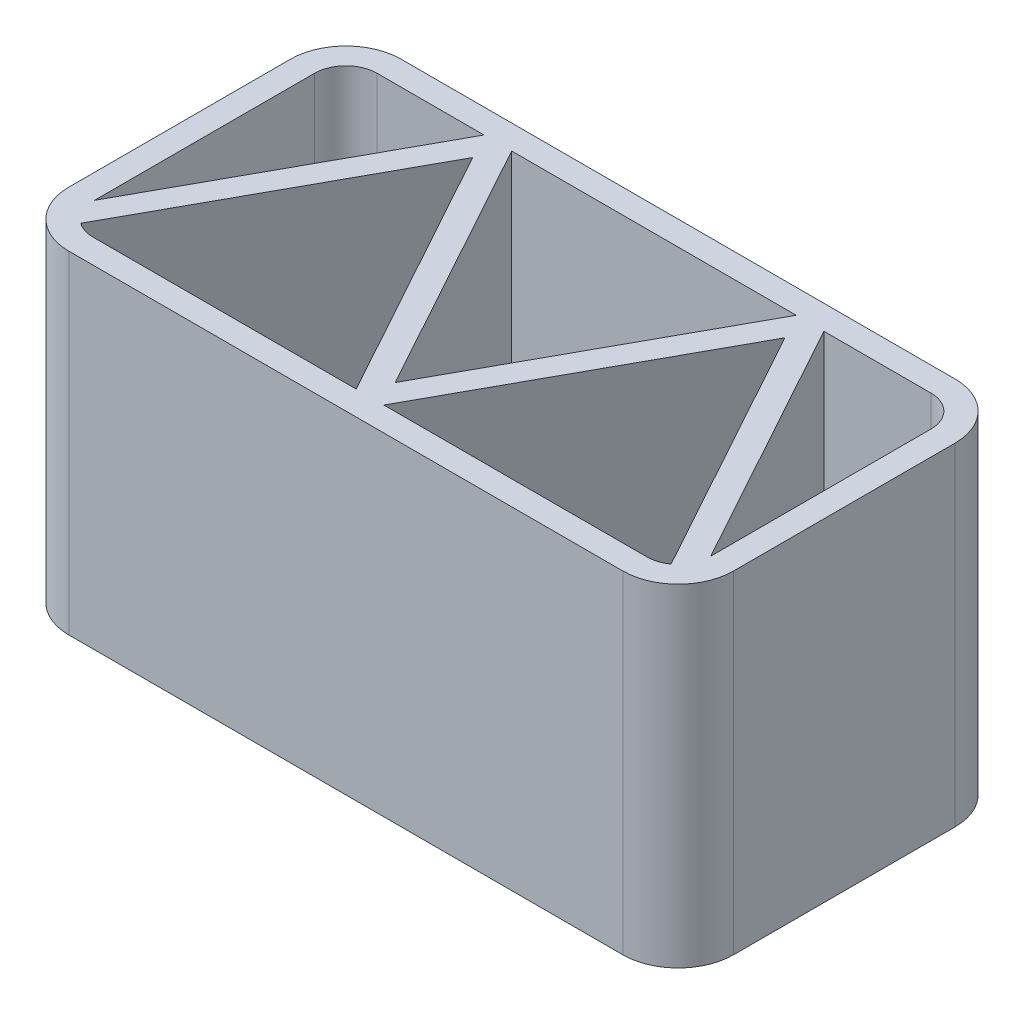
ISO-10303-21;
HEADER;
FILE_DESCRIPTION(('STEP AP214'),'2;1');
FILE_NAME('part.step','',(''),(''),'','','');
FILE_SCHEMA(('AUTOMOTIVE_DESIGN { 1 0 10303 214 1 1 1 1 }'));
ENDSEC;
DATA;
#1=APPLICATION_CONTEXT('core data for automotive mechanical design processes');
#2=APPLICATION_PROTOCOL_DEFINITION('international standard','automotive_design',2000,#1);
#3=PRODUCT_CONTEXT('',#1,'mechanical');
#4=PRODUCT('Part','Part','',(#3));
#5=PRODUCT_RELATED_PRODUCT_CATEGORY('part','',(#4));
#6=PRODUCT_DEFINITION_FORMATION('','',#4);
#7=PRODUCT_DEFINITION_CONTEXT('part definition',#1,'design');
#8=PRODUCT_DEFINITION('design','',#6,#7);
#9=PRODUCT_DEFINITION_SHAPE('','',#8);
#10=(LENGTH_UNIT() NAMED_UNIT(*) SI_UNIT(.MILLI.,.METRE.));
#11=(NAMED_UNIT(*) PLANE_ANGLE_UNIT() SI_UNIT($,.RADIAN.));
#12=(NAMED_UNIT(*) SI_UNIT($,.STERADIAN.) SOLID_ANGLE_UNIT());
#13=UNCERTAINTY_MEASURE_WITH_UNIT(LENGTH_MEASURE(1.E-05),#10,'distance_accuracy_value','');
#14=(GEOMETRIC_REPRESENTATION_CONTEXT(3) GLOBAL_UNCERTAINTY_ASSIGNED_CONTEXT((#13)) GLOBAL_UNIT_ASSIGNED_CONTEXT((#10,
#11,#12)) REPRESENTATION_CONTEXT('',''));
#15=CARTESIAN_POINT('',(0.,0.,0.));
#16=DIRECTION('',(0.,0.,1.));
#17=DIRECTION('',(1.,0.,0.));
#18=AXIS2_PLACEMENT_3D('',#15,#16,#17);
#19=CARTESIAN_POINT('',(254.,304.8,-130.175));
#20=DIRECTION('',(0.,0.,1.));
#21=DIRECTION('',(1.,0.,0.));
#22=AXIS2_PLACEMENT_3D('',#19,#20,#21);
#23=PLANE('',#22);
#24=DIRECTION('',(-1.,0.,0.));
#25=VECTOR('',#24,1.);
#26=CARTESIAN_POINT('',(254.,0.,-130.175));
#27=LINE('',#26,#25);
#28=CARTESIAN_POINT('',(-155.829753234846,0.,-130.175));
#29=VERTEX_POINT('',#28);
#30=CARTESIAN_POINT('',(-254.,0.,-130.175));
#31=VERTEX_POINT('',#30);
#32=EDGE_CURVE('E393',#29,#31,#27,.T.);
#33=ORIENTED_EDGE('',*,*,#32,.F.);
#34=DIRECTION('',(0.,1.,0.));
#35=VECTOR('',#34,1.);
#36=CARTESIAN_POINT('',(-155.829753234846,304.8,-130.175));
#37=LINE('',#36,#35);
#38=CARTESIAN_POINT('',(-155.829753234846,304.8,-130.175));
#39=VERTEX_POINT('',#38);
#40=EDGE_CURVE('E358',#29,#39,#37,.T.);
#41=ORIENTED_EDGE('',*,*,#40,.T.);
#42=DIRECTION('',(-1.,0.,0.));
#43=VECTOR('',#42,1.);
#44=CARTESIAN_POINT('',(254.,304.8,-130.175));
#45=LINE('',#44,#43);
#46=CARTESIAN_POINT('',(-254.,304.8,-130.175));
#47=VERTEX_POINT('',#46);
#48=EDGE_CURVE('E366',#39,#47,#45,.T.);
#49=ORIENTED_EDGE('',*,*,#48,.T.);
#50=DIRECTION('',(0.,-1.,0.));
#51=VECTOR('',#50,1.);
#52=CARTESIAN_POINT('',(-254.,304.8,-130.175));
#53=LINE('',#52,#51);
#54=EDGE_CURVE('E434',#47,#31,#53,.T.);
#55=ORIENTED_EDGE('',*,*,#54,.T.);
#56=EDGE_LOOP('',(#33,#41,#49,#55));
#57=FACE_BOUND('',#56,.T.);
#58=ADVANCED_FACE('F91',(#57),#23,.T.);
#59=CARTESIAN_POINT('',(130.466819062914,304.8,-130.175));
#60=VERTEX_POINT('',#59);
#61=CARTESIAN_POINT('',(-130.466819062914,304.8,-130.175));
#62=VERTEX_POINT('',#61);
#63=EDGE_CURVE('E106',#60,#62,#45,.T.);
#64=ORIENTED_EDGE('',*,*,#63,.T.);
#65=DIRECTION('',(0.,-1.,0.));
#66=VECTOR('',#65,1.);
#67=CARTESIAN_POINT('',(-130.466819062915,304.8,-130.175));
#68=LINE('',#67,#66);
#69=CARTESIAN_POINT('',(-130.466819062914,0.,-130.175));
#70=VERTEX_POINT('',#69);
#71=EDGE_CURVE('E12',#62,#70,#68,.T.);
#72=ORIENTED_EDGE('',*,*,#71,.T.);
#73=CARTESIAN_POINT('',(130.466819062914,0.,-130.175));
#74=VERTEX_POINT('',#73);
#75=EDGE_CURVE('E281',#74,#70,#27,.T.);
#76=ORIENTED_EDGE('',*,*,#75,.F.);
#77=DIRECTION('',(0.,1.,0.));
#78=VECTOR('',#77,1.);
#79=CARTESIAN_POINT('',(130.466819062914,304.8,-130.175));
#80=LINE('',#79,#78);
#81=EDGE_CURVE('E100',#74,#60,#80,.T.);
#82=ORIENTED_EDGE('',*,*,#81,.T.);
#83=EDGE_LOOP('',(#64,#72,#76,#82));
#84=FACE_BOUND('',#83,.T.);
#85=ADVANCED_FACE('F547',(#84),#23,.T.);
#86=CARTESIAN_POINT('',(254.,304.8,-130.175));
#87=VERTEX_POINT('',#86);
#88=CARTESIAN_POINT('',(155.829753234846,304.8,-130.175));
#89=VERTEX_POINT('',#88);
#90=EDGE_CURVE('E116',#87,#89,#45,.T.);
#91=ORIENTED_EDGE('',*,*,#90,.T.);
#92=DIRECTION('',(0.,-1.,0.));
#93=VECTOR('',#92,1.);
#94=CARTESIAN_POINT('',(155.829753234846,304.8,-130.175));
#95=LINE('',#94,#93);
#96=CARTESIAN_POINT('',(155.829753234846,0.,-130.175));
#97=VERTEX_POINT('',#96);
#98=EDGE_CURVE('E352',#89,#97,#95,.T.);
#99=ORIENTED_EDGE('',*,*,#98,.T.);
#100=CARTESIAN_POINT('',(254.,0.,-130.175));
#101=VERTEX_POINT('',#100);
#102=EDGE_CURVE('E394',#101,#97,#27,.T.);
#103=ORIENTED_EDGE('',*,*,#102,.F.);
#104=DIRECTION('',(0.,-1.,0.));
#105=VECTOR('',#104,1.);
#106=CARTESIAN_POINT('',(254.,304.8,-130.175));
#107=LINE('',#106,#105);
#108=EDGE_CURVE('E438',#87,#101,#107,.T.);
#109=ORIENTED_EDGE('',*,*,#108,.F.);
#110=EDGE_LOOP('',(#91,#99,#103,#109));
#111=FACE_BOUND('',#110,.T.);
#112=ADVANCED_FACE('F611',(#111),#23,.T.);
#113=CARTESIAN_POINT('',(-282.575,304.8,-101.6));
#114=DIRECTION('',(1.,0.,0.));
#115=DIRECTION('',(0.,0.,-1.));
#116=AXIS2_PLACEMENT_3D('',#113,#114,#115);
#117=PLANE('',#116);
#118=DIRECTION('',(0.,0.,1.));
#119=VECTOR('',#118,1.);
#120=CARTESIAN_POINT('',(-282.575,304.8,-101.6));
#121=LINE('',#120,#119);
#122=CARTESIAN_POINT('',(-282.575,304.8,-101.6));
#123=VERTEX_POINT('',#122);
#124=CARTESIAN_POINT('',(-282.575,304.8,100.342080455916));
#125=VERTEX_POINT('',#124);
#126=EDGE_CURVE('E373',#123,#125,#121,.T.);
#127=ORIENTED_EDGE('',*,*,#126,.T.);
#128=DIRECTION('',(0.,-1.,0.));
#129=VECTOR('',#128,1.);
#130=CARTESIAN_POINT('',(-282.575,304.8,100.342080455916));
#131=LINE('',#130,#129);
#132=CARTESIAN_POINT('',(-282.575,0.,100.342080455916));
#133=VERTEX_POINT('',#132);
#134=EDGE_CURVE('E544',#125,#133,#131,.T.);
#135=ORIENTED_EDGE('',*,*,#134,.T.);
#136=DIRECTION('',(0.,0.,1.));
#137=VECTOR('',#136,1.);
#138=CARTESIAN_POINT('',(-282.575,0.,-101.6));
#139=LINE('',#138,#137);
#140=CARTESIAN_POINT('',(-282.575,0.,-101.6));
#141=VERTEX_POINT('',#140);
#142=EDGE_CURVE('E402',#141,#133,#139,.T.);
#143=ORIENTED_EDGE('',*,*,#142,.F.);
#144=DIRECTION('',(0.,-1.,0.));
#145=VECTOR('',#144,1.);
#146=CARTESIAN_POINT('',(-282.575,304.8,-101.6));
#147=LINE('',#146,#145);
#148=EDGE_CURVE('E431',#123,#141,#147,.T.);
#149=ORIENTED_EDGE('',*,*,#148,.F.);
#150=EDGE_LOOP('',(#127,#135,#143,#149));
#151=FACE_BOUND('',#150,.T.);
#152=ADVANCED_FACE('F566',(#151),#117,.T.);
#153=CARTESIAN_POINT('',(254.,304.8,130.175));
#154=DIRECTION('',(0.,0.,-1.));
#155=DIRECTION('',(-1.,0.,0.));
#156=AXIS2_PLACEMENT_3D('',#153,#154,#155);
#157=PLANE('',#156);
#158=DIRECTION('',(0.,-1.,0.));
#159=VECTOR('',#158,1.);
#160=CARTESIAN_POINT('',(12.6814670859659,304.8,130.175));
#161=LINE('',#160,#159);
#162=CARTESIAN_POINT('',(12.6814670859659,304.8,130.175));
#163=VERTEX_POINT('',#162);
#164=CARTESIAN_POINT('',(12.6814670859659,0.,130.175));
#165=VERTEX_POINT('',#164);
#166=EDGE_CURVE('E536',#163,#165,#161,.T.);
#167=ORIENTED_EDGE('',*,*,#166,.F.);
#168=DIRECTION('',(1.,0.,0.));
#169=VECTOR('',#168,1.);
#170=CARTESIAN_POINT('',(254.,304.8,130.175));
#171=LINE('',#170,#169);
#172=CARTESIAN_POINT('',(254.,304.8,130.175));
#173=VERTEX_POINT('',#172);
#174=EDGE_CURVE('E379',#163,#173,#171,.T.);
#175=ORIENTED_EDGE('',*,*,#174,.T.);
#176=DIRECTION('',(0.,-1.,0.));
#177=VECTOR('',#176,1.);
#178=CARTESIAN_POINT('',(254.,304.8,130.175));
#179=LINE('',#178,#177);
#180=CARTESIAN_POINT('',(254.,0.,130.175));
#181=VERTEX_POINT('',#180);
#182=EDGE_CURVE('E423',#173,#181,#179,.T.);
#183=ORIENTED_EDGE('',*,*,#182,.T.);
#184=DIRECTION('',(1.,0.,0.));
#185=VECTOR('',#184,1.);
#186=CARTESIAN_POINT('',(254.,0.,130.175));
#187=LINE('',#186,#185);
#188=EDGE_CURVE('E409',#165,#181,#187,.T.);
#189=ORIENTED_EDGE('',*,*,#188,.F.);
#190=EDGE_LOOP('',(#167,#175,#183,#189));
#191=FACE_BOUND('',#190,.T.);
#192=ADVANCED_FACE('F584',(#191),#157,.T.);
#193=CARTESIAN_POINT('',(282.575,304.8,-101.6));
#194=DIRECTION('',(-1.,0.,0.));
#195=DIRECTION('',(0.,0.,1.));
#196=AXIS2_PLACEMENT_3D('',#193,#194,#195);
#197=PLANE('',#196);
#198=DIRECTION('',(0.,0.,-1.));
#199=VECTOR('',#198,1.);
#200=CARTESIAN_POINT('',(282.575,0.,-101.6));
#201=LINE('',#200,#199);
#202=CARTESIAN_POINT('',(282.575,0.,100.342080455916));
#203=VERTEX_POINT('',#202);
#204=CARTESIAN_POINT('',(282.575,0.,-101.6));
#205=VERTEX_POINT('',#204);
#206=EDGE_CURVE('E367',#203,#205,#201,.T.);
#207=ORIENTED_EDGE('',*,*,#206,.F.);
#208=DIRECTION('',(0.,1.,0.));
#209=VECTOR('',#208,1.);
#210=CARTESIAN_POINT('',(282.575,304.8,100.342080455916));
#211=LINE('',#210,#209);
#212=CARTESIAN_POINT('',(282.575,304.8,100.342080455916));
#213=VERTEX_POINT('',#212);
#214=EDGE_CURVE('E524',#203,#213,#211,.T.);
#215=ORIENTED_EDGE('',*,*,#214,.T.);
#216=DIRECTION('',(0.,0.,-1.));
#217=VECTOR('',#216,1.);
#218=CARTESIAN_POINT('',(282.575,304.8,-101.6));
#219=LINE('',#218,#217);
#220=CARTESIAN_POINT('',(282.575,304.8,-101.6));
#221=VERTEX_POINT('',#220);
#222=EDGE_CURVE('E386',#213,#221,#219,.T.);
#223=ORIENTED_EDGE('',*,*,#222,.T.);
#224=DIRECTION('',(0.,-1.,0.));
#225=VECTOR('',#224,1.);
#226=CARTESIAN_POINT('',(282.575,304.8,-101.6));
#227=LINE('',#226,#225);
#228=EDGE_CURVE('E389',#221,#205,#227,.T.);
#229=ORIENTED_EDGE('',*,*,#228,.T.);
#230=EDGE_LOOP('',(#207,#215,#223,#229));
#231=FACE_BOUND('',#230,.T.);
#232=ADVANCED_FACE('F625',(#231),#197,.T.);
#233=CARTESIAN_POINT('',(254.,304.8,-101.6));
#234=DIRECTION('',(0.,1.,0.));
#235=DIRECTION('',(0.,0.,1.));
#236=AXIS2_PLACEMENT_3D('',#233,#234,#235);
#237=PLANE('',#236);
#238=ORIENTED_EDGE('',*,*,#174,.F.);
#239=DIRECTION('',(0.481804493282131,0.,-0.876278740044028));
#240=VECTOR('',#239,1.);
#241=CARTESIAN_POINT('',(11.9633954984511,304.8,131.480987957236));
#242=LINE('',#241,#240);
#243=CARTESIAN_POINT('',(143.14828614888,304.8,-107.110665493072));
#244=VERTEX_POINT('',#243);
#245=EDGE_CURVE('E345',#163,#244,#242,.T.);
#246=ORIENTED_EDGE('',*,*,#245,.T.);
#247=DIRECTION('',(0.481804493282129,0.,0.876278740044029));
#248=VECTOR('',#247,1.);
#249=CARTESIAN_POINT('',(135.636386649853,304.8,-120.772883094041));
#250=LINE('',#249,#248);
#251=CARTESIAN_POINT('',(270.666076641867,304.8,124.81147376552));
#252=VERTEX_POINT('',#251);
#253=EDGE_CURVE('E321',#244,#252,#250,.T.);
#254=ORIENTED_EDGE('',*,*,#253,.T.);
#255=CARTESIAN_POINT('',(254.,304.8,101.6));
#256=DIRECTION('',(0.,-1.,0.));
#257=DIRECTION('',(-1.,0.,0.));
#258=AXIS2_PLACEMENT_3D('',#255,#256,#257);
#259=CIRCLE('',#258,28.575);
#260=EDGE_CURVE('E383',#173,#252,#259,.F.);
#261=ORIENTED_EDGE('',*,*,#260,.F.);
#262=EDGE_LOOP('',(#238,#246,#254,#261));
#263=FACE_BOUND('',#262,.T.);
#264=CARTESIAN_POINT('',(-254.,304.8,101.6));
#265=DIRECTION('',(0.,-1.,0.));
#266=DIRECTION('',(-1.,0.,0.));
#267=AXIS2_PLACEMENT_3D('',#264,#265,#266);
#268=CIRCLE('',#267,28.575);
#269=CARTESIAN_POINT('',(-270.666076641867,304.8,124.81147376552));
#270=VERTEX_POINT('',#269);
#271=CARTESIAN_POINT('',(-254.,304.8,130.175));
#272=VERTEX_POINT('',#271);
#273=EDGE_CURVE('E376',#270,#272,#268,.F.);
#274=ORIENTED_EDGE('',*,*,#273,.F.);
#275=DIRECTION('',(0.481804493282129,0.,-0.876278740044029));
#276=VECTOR('',#275,1.);
#277=CARTESIAN_POINT('',(-276.558924799021,304.8,135.529052431598));
#278=LINE('',#277,#276);
#279=CARTESIAN_POINT('',(-143.14828614888,304.8,-107.110665493072));
#280=VERTEX_POINT('',#279);
#281=EDGE_CURVE('E338',#270,#280,#278,.T.);
#282=ORIENTED_EDGE('',*,*,#281,.T.);
#283=DIRECTION('',(0.481804493282131,0.,0.876278740044028));
#284=VECTOR('',#283,1.);
#285=CARTESIAN_POINT('',(-150.660185647908,304.8,-120.772883094041));
#286=LINE('',#285,#284);
#287=CARTESIAN_POINT('',(-12.6814670859659,304.8,130.175));
#288=VERTEX_POINT('',#287);
#289=EDGE_CURVE('E341',#280,#288,#286,.T.);
#290=ORIENTED_EDGE('',*,*,#289,.T.);
#291=EDGE_CURVE('E380',#272,#288,#171,.T.);
#292=ORIENTED_EDGE('',*,*,#291,.F.);
#293=EDGE_LOOP('',(#274,#282,#290,#292));
#294=FACE_BOUND('',#293,.T.);
#295=DIRECTION('',(0.481804493282129,0.,-0.876278740044029));
#296=VECTOR('',#295,1.);
#297=CARTESIAN_POINT('',(-296.034219796499,304.8,124.820947568402));
#298=LINE('',#297,#296);
#299=EDGE_CURVE('E334',#125,#39,#298,.T.);
#300=ORIENTED_EDGE('',*,*,#299,.F.);
#301=ORIENTED_EDGE('',*,*,#126,.F.);
#302=CARTESIAN_POINT('',(-254.,304.8,-101.6));
#303=DIRECTION('',(0.,-1.,0.));
#304=DIRECTION('',(-1.,0.,0.));
#305=AXIS2_PLACEMENT_3D('',#302,#303,#304);
#306=CIRCLE('',#305,28.575);
#307=EDGE_CURVE('E370',#47,#123,#306,.F.);
#308=ORIENTED_EDGE('',*,*,#307,.F.);
#309=ORIENTED_EDGE('',*,*,#48,.F.);
#310=EDGE_LOOP('',(#300,#301,#308,#309));
#311=FACE_BOUND('',#310,.T.);
#312=DIRECTION('',(0.481804493282131,0.,0.876278740044028));
#313=VECTOR('',#312,1.);
#314=CARTESIAN_POINT('',(-131.184890650429,304.8,-131.480987957236));
#315=LINE('',#314,#313);
#316=CARTESIAN_POINT('',(0.,304.8,107.110665493072));
#317=VERTEX_POINT('',#316);
#318=EDGE_CURVE('E290',#62,#317,#315,.T.);
#319=ORIENTED_EDGE('',*,*,#318,.F.);
#320=ORIENTED_EDGE('',*,*,#63,.F.);
#321=DIRECTION('',(0.481804493282131,0.,-0.876278740044028));
#322=VECTOR('',#321,1.);
#323=CARTESIAN_POINT('',(-7.51189949902741,304.8,120.772883094041));
#324=LINE('',#323,#322);
#325=EDGE_CURVE('E329',#317,#60,#324,.T.);
#326=ORIENTED_EDGE('',*,*,#325,.F.);
#327=EDGE_LOOP('',(#319,#320,#326));
#328=FACE_BOUND('',#327,.T.);
#329=DIRECTION('',(0.481804493282129,0.,0.876278740044029));
#330=VECTOR('',#329,1.);
#331=CARTESIAN_POINT('',(155.111681647331,304.8,-131.480987957236));
#332=LINE('',#331,#330);
#333=EDGE_CURVE('E325',#89,#213,#332,.T.);
#334=ORIENTED_EDGE('',*,*,#333,.F.);
#335=ORIENTED_EDGE('',*,*,#90,.F.);
#336=CARTESIAN_POINT('',(254.,304.8,-101.6));
#337=DIRECTION('',(0.,-1.,0.));
#338=DIRECTION('',(-1.,0.,0.));
#339=AXIS2_PLACEMENT_3D('',#336,#337,#338);
#340=CIRCLE('',#339,28.5750000000001);
#341=EDGE_CURVE('E363',#221,#87,#340,.F.);
#342=ORIENTED_EDGE('',*,*,#341,.F.);
#343=ORIENTED_EDGE('',*,*,#222,.F.);
#344=EDGE_LOOP('',(#334,#335,#342,#343));
#345=FACE_BOUND('',#344,.T.);
#346=CARTESIAN_POINT('',(254.,304.8,-101.6));
#347=DIRECTION('',(0.,1.,0.));
#348=DIRECTION('',(0.,0.,-1.));
#349=AXIS2_PLACEMENT_3D('',#346,#347,#348);
#350=CIRCLE('',#349,50.8000000000001);
#351=CARTESIAN_POINT('',(304.8,304.8,-101.6));
#352=VERTEX_POINT('',#351);
#353=CARTESIAN_POINT('',(254.,304.8,-152.4));
#354=VERTEX_POINT('',#353);
#355=EDGE_CURVE('E443',#352,#354,#350,.T.);
#356=ORIENTED_EDGE('',*,*,#355,.T.);
#357=DIRECTION('',(-1.,0.,0.));
#358=VECTOR('',#357,1.);
#359=CARTESIAN_POINT('',(-254.,304.8,-152.4));
#360=LINE('',#359,#358);
#361=CARTESIAN_POINT('',(-254.,304.8,-152.4));
#362=VERTEX_POINT('',#361);
#363=EDGE_CURVE('E447',#354,#362,#360,.T.);
#364=ORIENTED_EDGE('',*,*,#363,.T.);
#365=CARTESIAN_POINT('',(-254.,304.8,-101.6));
#366=DIRECTION('',(0.,1.,0.));
#367=DIRECTION('',(0.,0.,1.));
#368=AXIS2_PLACEMENT_3D('',#365,#366,#367);
#369=CIRCLE('',#368,50.8);
#370=CARTESIAN_POINT('',(-304.8,304.8,-101.6));
#371=VERTEX_POINT('',#370);
#372=EDGE_CURVE('E451',#362,#371,#369,.T.);
#373=ORIENTED_EDGE('',*,*,#372,.T.);
#374=DIRECTION('',(0.,0.,1.));
#375=VECTOR('',#374,1.);
#376=CARTESIAN_POINT('',(-304.8,304.8,-101.6));
#377=LINE('',#376,#375);
#378=CARTESIAN_POINT('',(-304.8,304.8,101.6));
#379=VERTEX_POINT('',#378);
#380=EDGE_CURVE('E454',#371,#379,#377,.T.);
#381=ORIENTED_EDGE('',*,*,#380,.T.);
#382=CARTESIAN_POINT('',(-254.,304.8,101.6));
#383=DIRECTION('',(0.,1.,0.));
#384=DIRECTION('',(0.,0.,1.));
#385=AXIS2_PLACEMENT_3D('',#382,#383,#384);
#386=CIRCLE('',#385,50.8);
#387=CARTESIAN_POINT('',(-254.,304.8,152.4));
#388=VERTEX_POINT('',#387);
#389=EDGE_CURVE('E457',#379,#388,#386,.T.);
#390=ORIENTED_EDGE('',*,*,#389,.T.);
#391=DIRECTION('',(1.,0.,0.));
#392=VECTOR('',#391,1.);
#393=CARTESIAN_POINT('',(-254.,304.8,152.4));
#394=LINE('',#393,#392);
#395=CARTESIAN_POINT('',(254.,304.8,152.4));
#396=VERTEX_POINT('',#395);
#397=EDGE_CURVE('E460',#388,#396,#394,.T.);
#398=ORIENTED_EDGE('',*,*,#397,.T.);
#399=CARTESIAN_POINT('',(254.,304.8,101.6));
#400=DIRECTION('',(0.,1.,0.));
#401=DIRECTION('',(0.,0.,1.));
#402=AXIS2_PLACEMENT_3D('',#399,#400,#401);
#403=CIRCLE('',#402,50.8);
#404=CARTESIAN_POINT('',(304.8,304.8,101.6));
#405=VERTEX_POINT('',#404);
#406=EDGE_CURVE('E463',#396,#405,#403,.T.);
#407=ORIENTED_EDGE('',*,*,#406,.T.);
#408=DIRECTION('',(0.,0.,-1.));
#409=VECTOR('',#408,1.);
#410=CARTESIAN_POINT('',(304.8,304.8,-101.6));
#411=LINE('',#410,#409);
#412=EDGE_CURVE('E466',#405,#352,#411,.T.);
#413=ORIENTED_EDGE('',*,*,#412,.T.);
#414=EDGE_LOOP('',(#356,#364,#373,#381,#390,#398,#407,#413));
#415=FACE_BOUND('',#414,.T.);
#416=ADVANCED_FACE('F549',(#263,#294,#311,#328,#345,#415),#237,.T.);
#417=CARTESIAN_POINT('',(254.,0.,-101.6));
#418=DIRECTION('',(0.,1.,0.));
#419=DIRECTION('',(0.,0.,1.));
#420=AXIS2_PLACEMENT_3D('',#417,#418,#419);
#421=PLANE('',#420);
#422=DIRECTION('',(0.481804493282131,0.,-0.876278740044028));
#423=VECTOR('',#422,1.);
#424=CARTESIAN_POINT('',(11.9633954984511,0.,131.480987957236));
#425=LINE('',#424,#423);
#426=CARTESIAN_POINT('',(143.14828614888,0.,-107.110665493072));
#427=VERTEX_POINT('',#426);
#428=EDGE_CURVE('E296',#165,#427,#425,.T.);
#429=ORIENTED_EDGE('',*,*,#428,.F.);
#430=ORIENTED_EDGE('',*,*,#188,.T.);
#431=CARTESIAN_POINT('',(254.,0.,101.6));
#432=DIRECTION('',(0.,-1.,0.));
#433=DIRECTION('',(-1.,0.,0.));
#434=AXIS2_PLACEMENT_3D('',#431,#432,#433);
#435=CIRCLE('',#434,28.575);
#436=CARTESIAN_POINT('',(270.666076641867,0.,124.81147376552));
#437=VERTEX_POINT('',#436);
#438=EDGE_CURVE('E414',#181,#437,#435,.F.);
#439=ORIENTED_EDGE('',*,*,#438,.T.);
#440=DIRECTION('',(0.481804493282129,0.,0.876278740044029));
#441=VECTOR('',#440,1.);
#442=CARTESIAN_POINT('',(135.636386649853,0.,-120.772883094041));
#443=LINE('',#442,#441);
#444=EDGE_CURVE('E305',#427,#437,#443,.T.);
#445=ORIENTED_EDGE('',*,*,#444,.F.);
#446=EDGE_LOOP('',(#429,#430,#439,#445));
#447=FACE_BOUND('',#446,.T.);
#448=DIRECTION('',(0.481804493282129,0.,-0.876278740044029));
#449=VECTOR('',#448,1.);
#450=CARTESIAN_POINT('',(-276.558924799021,0.,135.529052431598));
#451=LINE('',#450,#449);
#452=CARTESIAN_POINT('',(-270.666076641867,0.,124.81147376552));
#453=VERTEX_POINT('',#452);
#454=CARTESIAN_POINT('',(-143.14828614888,0.,-107.110665493072));
#455=VERTEX_POINT('',#454);
#456=EDGE_CURVE('E312',#453,#455,#451,.T.);
#457=ORIENTED_EDGE('',*,*,#456,.F.);
#458=CARTESIAN_POINT('',(-254.,0.,101.6));
#459=DIRECTION('',(0.,-1.,0.));
#460=DIRECTION('',(-1.,0.,0.));
#461=AXIS2_PLACEMENT_3D('',#458,#459,#460);
#462=CIRCLE('',#461,28.575);
#463=CARTESIAN_POINT('',(-254.,0.,130.175));
#464=VERTEX_POINT('',#463);
#465=EDGE_CURVE('E406',#453,#464,#462,.F.);
#466=ORIENTED_EDGE('',*,*,#465,.T.);
#467=CARTESIAN_POINT('',(-12.6814670859659,0.,130.175));
#468=VERTEX_POINT('',#467);
#469=EDGE_CURVE('E410',#464,#468,#187,.T.);
#470=ORIENTED_EDGE('',*,*,#469,.T.);
#471=DIRECTION('',(0.481804493282131,0.,0.876278740044028));
#472=VECTOR('',#471,1.);
#473=CARTESIAN_POINT('',(-150.660185647908,0.,-120.772883094041));
#474=LINE('',#473,#472);
#475=EDGE_CURVE('E315',#455,#468,#474,.T.);
#476=ORIENTED_EDGE('',*,*,#475,.F.);
#477=EDGE_LOOP('',(#457,#466,#470,#476));
#478=FACE_BOUND('',#477,.T.);
#479=ORIENTED_EDGE('',*,*,#142,.T.);
#480=DIRECTION('',(0.481804493282129,0.,-0.876278740044029));
#481=VECTOR('',#480,1.);
#482=CARTESIAN_POINT('',(-296.034219796499,0.,124.820947568402));
#483=LINE('',#482,#481);
#484=EDGE_CURVE('E284',#133,#29,#483,.T.);
#485=ORIENTED_EDGE('',*,*,#484,.T.);
#486=ORIENTED_EDGE('',*,*,#32,.T.);
#487=CARTESIAN_POINT('',(-254.,0.,-101.6));
#488=DIRECTION('',(0.,-1.,0.));
#489=DIRECTION('',(-1.,0.,0.));
#490=AXIS2_PLACEMENT_3D('',#487,#488,#489);
#491=CIRCLE('',#490,28.575);
#492=EDGE_CURVE('E398',#31,#141,#491,.F.);
#493=ORIENTED_EDGE('',*,*,#492,.T.);
#494=EDGE_LOOP('',(#479,#485,#486,#493));
#495=FACE_BOUND('',#494,.T.);
#496=ORIENTED_EDGE('',*,*,#75,.T.);
#497=DIRECTION('',(0.481804493282131,0.,0.876278740044028));
#498=VECTOR('',#497,1.);
#499=CARTESIAN_POINT('',(-131.184890650429,0.,-131.480987957236));
#500=LINE('',#499,#498);
#501=CARTESIAN_POINT('',(0.,0.,107.110665493072));
#502=VERTEX_POINT('',#501);
#503=EDGE_CURVE('E275',#70,#502,#500,.T.);
#504=ORIENTED_EDGE('',*,*,#503,.T.);
#505=DIRECTION('',(0.481804493282131,0.,-0.876278740044028));
#506=VECTOR('',#505,1.);
#507=CARTESIAN_POINT('',(-7.51189949902741,0.,120.772883094041));
#508=LINE('',#507,#506);
#509=EDGE_CURVE('E280',#502,#74,#508,.T.);
#510=ORIENTED_EDGE('',*,*,#509,.T.);
#511=EDGE_LOOP('',(#496,#504,#510));
#512=FACE_BOUND('',#511,.T.);
#513=ORIENTED_EDGE('',*,*,#102,.T.);
#514=DIRECTION('',(0.481804493282129,0.,0.876278740044029));
#515=VECTOR('',#514,1.);
#516=CARTESIAN_POINT('',(155.111681647331,0.,-131.480987957236));
#517=LINE('',#516,#515);
#518=EDGE_CURVE('E301',#97,#203,#517,.T.);
#519=ORIENTED_EDGE('',*,*,#518,.T.);
#520=ORIENTED_EDGE('',*,*,#206,.T.);
#521=CARTESIAN_POINT('',(254.,0.,-101.6));
#522=DIRECTION('',(0.,-1.,0.));
#523=DIRECTION('',(-1.,0.,0.));
#524=AXIS2_PLACEMENT_3D('',#521,#522,#523);
#525=CIRCLE('',#524,28.5750000000001);
#526=EDGE_CURVE('E362',#205,#101,#525,.F.);
#527=ORIENTED_EDGE('',*,*,#526,.T.);
#528=EDGE_LOOP('',(#513,#519,#520,#527));
#529=FACE_BOUND('',#528,.T.);
#530=CARTESIAN_POINT('',(254.,0.,-101.6));
#531=DIRECTION('',(0.,1.,0.));
#532=DIRECTION('',(0.,0.,-1.));
#533=AXIS2_PLACEMENT_3D('',#530,#531,#532);
#534=CIRCLE('',#533,50.8000000000001);
#535=CARTESIAN_POINT('',(304.8,0.,-101.6));
#536=VERTEX_POINT('',#535);
#537=CARTESIAN_POINT('',(254.,0.,-152.4));
#538=VERTEX_POINT('',#537);
#539=EDGE_CURVE('E442',#536,#538,#534,.T.);
#540=ORIENTED_EDGE('',*,*,#539,.F.);
#541=DIRECTION('',(0.,0.,-1.));
#542=VECTOR('',#541,1.);
#543=CARTESIAN_POINT('',(304.8,0.,-101.6));
#544=LINE('',#543,#542);
#545=CARTESIAN_POINT('',(304.8,0.,101.6));
#546=VERTEX_POINT('',#545);
#547=EDGE_CURVE('E448',#546,#536,#544,.T.);
#548=ORIENTED_EDGE('',*,*,#547,.F.);
#549=CARTESIAN_POINT('',(254.,0.,101.6));
#550=DIRECTION('',(0.,1.,0.));
#551=DIRECTION('',(0.,0.,1.));
#552=AXIS2_PLACEMENT_3D('',#549,#550,#551);
#553=CIRCLE('',#552,50.8);
#554=CARTESIAN_POINT('',(254.,0.,152.4));
#555=VERTEX_POINT('',#554);
#556=EDGE_CURVE('E488',#555,#546,#553,.T.);
#557=ORIENTED_EDGE('',*,*,#556,.F.);
#558=DIRECTION('',(1.,0.,0.));
#559=VECTOR('',#558,1.);
#560=CARTESIAN_POINT('',(-254.,0.,152.4));
#561=LINE('',#560,#559);
#562=CARTESIAN_POINT('',(-254.,0.,152.4));
#563=VERTEX_POINT('',#562);
#564=EDGE_CURVE('E485',#563,#555,#561,.T.);
#565=ORIENTED_EDGE('',*,*,#564,.F.);
#566=CARTESIAN_POINT('',(-254.,0.,101.6));
#567=DIRECTION('',(0.,1.,0.));
#568=DIRECTION('',(0.,0.,1.));
#569=AXIS2_PLACEMENT_3D('',#566,#567,#568);
#570=CIRCLE('',#569,50.8);
#571=CARTESIAN_POINT('',(-304.8,0.,101.6));
#572=VERTEX_POINT('',#571);
#573=EDGE_CURVE('E482',#572,#563,#570,.T.);
#574=ORIENTED_EDGE('',*,*,#573,.F.);
#575=DIRECTION('',(0.,0.,1.));
#576=VECTOR('',#575,1.);
#577=CARTESIAN_POINT('',(-304.8,0.,-101.6));
#578=LINE('',#577,#576);
#579=CARTESIAN_POINT('',(-304.8,0.,-101.6));
#580=VERTEX_POINT('',#579);
#581=EDGE_CURVE('E479',#580,#572,#578,.T.);
#582=ORIENTED_EDGE('',*,*,#581,.F.);
#583=CARTESIAN_POINT('',(-254.,0.,-101.6));
#584=DIRECTION('',(0.,1.,0.));
#585=DIRECTION('',(0.,0.,1.));
#586=AXIS2_PLACEMENT_3D('',#583,#584,#585);
#587=CIRCLE('',#586,50.8);
#588=CARTESIAN_POINT('',(-254.,0.,-152.4));
#589=VERTEX_POINT('',#588);
#590=EDGE_CURVE('E476',#589,#580,#587,.T.);
#591=ORIENTED_EDGE('',*,*,#590,.F.);
#592=DIRECTION('',(-1.,0.,0.));
#593=VECTOR('',#592,1.);
#594=CARTESIAN_POINT('',(-254.,0.,-152.4));
#595=LINE('',#594,#593);
#596=EDGE_CURVE('E473',#538,#589,#595,.T.);
#597=ORIENTED_EDGE('',*,*,#596,.F.);
#598=EDGE_LOOP('',(#540,#548,#557,#565,#574,#582,#591,#597));
#599=FACE_BOUND('',#598,.T.);
#600=ADVANCED_FACE('F277',(#447,#478,#495,#512,#529,#599),#421,.F.);
#601=CARTESIAN_POINT('',(254.,304.8,-101.6));
#602=DIRECTION('',(0.,-1.,0.));
#603=DIRECTION('',(0.,0.,-1.));
#604=AXIS2_PLACEMENT_3D('',#601,#602,#603);
#605=CYLINDRICAL_SURFACE('',#604,50.8000000000001);
#606=ORIENTED_EDGE('',*,*,#539,.T.);
#607=DIRECTION('',(0.,-1.,0.));
#608=VECTOR('',#607,1.);
#609=CARTESIAN_POINT('',(254.,304.8,-152.4));
#610=LINE('',#609,#608);
#611=EDGE_CURVE('E520',#354,#538,#610,.T.);
#612=ORIENTED_EDGE('',*,*,#611,.F.);
#613=ORIENTED_EDGE('',*,*,#355,.F.);
#614=DIRECTION('',(0.,-1.,0.));
#615=VECTOR('',#614,1.);
#616=CARTESIAN_POINT('',(304.8,304.8,-101.6));
#617=LINE('',#616,#615);
#618=EDGE_CURVE('E469',#352,#536,#617,.T.);
#619=ORIENTED_EDGE('',*,*,#618,.T.);
#620=EDGE_LOOP('',(#606,#612,#613,#619));
#621=FACE_BOUND('',#620,.T.);
#622=ADVANCED_FACE('F93',(#621),#605,.T.);
#623=CARTESIAN_POINT('',(-254.,304.8,-152.4));
#624=DIRECTION('',(0.,0.,1.));
#625=DIRECTION('',(1.,0.,0.));
#626=AXIS2_PLACEMENT_3D('',#623,#624,#625);
#627=PLANE('',#626);
#628=ORIENTED_EDGE('',*,*,#596,.T.);
#629=DIRECTION('',(0.,-1.,0.));
#630=VECTOR('',#629,1.);
#631=CARTESIAN_POINT('',(-254.,304.8,-152.4));
#632=LINE('',#631,#630);
#633=EDGE_CURVE('E516',#362,#589,#632,.T.);
#634=ORIENTED_EDGE('',*,*,#633,.F.);
#635=ORIENTED_EDGE('',*,*,#363,.F.);
#636=ORIENTED_EDGE('',*,*,#611,.T.);
#637=EDGE_LOOP('',(#628,#634,#635,#636));
#638=FACE_BOUND('',#637,.T.);
#639=ADVANCED_FACE('F668',(#638),#627,.F.);
#640=CARTESIAN_POINT('',(-254.,304.8,-101.6));
#641=DIRECTION('',(0.,-1.,0.));
#642=DIRECTION('',(0.,0.,-1.));
#643=AXIS2_PLACEMENT_3D('',#640,#641,#642);
#644=CYLINDRICAL_SURFACE('',#643,50.8);
#645=ORIENTED_EDGE('',*,*,#590,.T.);
#646=DIRECTION('',(0.,-1.,0.));
#647=VECTOR('',#646,1.);
#648=CARTESIAN_POINT('',(-304.8,304.8,-101.6));
#649=LINE('',#648,#647);
#650=EDGE_CURVE('E512',#371,#580,#649,.T.);
#651=ORIENTED_EDGE('',*,*,#650,.F.);
#652=ORIENTED_EDGE('',*,*,#372,.F.);
#653=ORIENTED_EDGE('',*,*,#633,.T.);
#654=EDGE_LOOP('',(#645,#651,#652,#653));
#655=FACE_BOUND('',#654,.T.);
#656=ADVANCED_FACE('F665',(#655),#644,.T.);
#657=CARTESIAN_POINT('',(-304.8,304.8,-101.6));
#658=DIRECTION('',(1.,0.,0.));
#659=DIRECTION('',(0.,0.,-1.));
#660=AXIS2_PLACEMENT_3D('',#657,#658,#659);
#661=PLANE('',#660);
#662=ORIENTED_EDGE('',*,*,#581,.T.);
#663=DIRECTION('',(0.,-1.,0.));
#664=VECTOR('',#663,1.);
#665=CARTESIAN_POINT('',(-304.8,304.8,101.6));
#666=LINE('',#665,#664);
#667=EDGE_CURVE('E508',#379,#572,#666,.T.);
#668=ORIENTED_EDGE('',*,*,#667,.F.);
#669=ORIENTED_EDGE('',*,*,#380,.F.);
#670=ORIENTED_EDGE('',*,*,#650,.T.);
#671=EDGE_LOOP('',(#662,#668,#669,#670));
#672=FACE_BOUND('',#671,.T.);
#673=ADVANCED_FACE('F661',(#672),#661,.F.);
#674=CARTESIAN_POINT('',(-254.,304.8,101.6));
#675=DIRECTION('',(0.,-1.,0.));
#676=DIRECTION('',(0.,0.,-1.));
#677=AXIS2_PLACEMENT_3D('',#674,#675,#676);
#678=CYLINDRICAL_SURFACE('',#677,50.8);
#679=ORIENTED_EDGE('',*,*,#573,.T.);
#680=DIRECTION('',(0.,-1.,0.));
#681=VECTOR('',#680,1.);
#682=CARTESIAN_POINT('',(-254.,304.8,152.4));
#683=LINE('',#682,#681);
#684=EDGE_CURVE('E504',#388,#563,#683,.T.);
#685=ORIENTED_EDGE('',*,*,#684,.F.);
#686=ORIENTED_EDGE('',*,*,#389,.F.);
#687=ORIENTED_EDGE('',*,*,#667,.T.);
#688=EDGE_LOOP('',(#679,#685,#686,#687));
#689=FACE_BOUND('',#688,.T.);
#690=ADVANCED_FACE('F657',(#689),#678,.T.);
#691=CARTESIAN_POINT('',(-254.,304.8,152.4));
#692=DIRECTION('',(0.,0.,-1.));
#693=DIRECTION('',(-1.,0.,0.));
#694=AXIS2_PLACEMENT_3D('',#691,#692,#693);
#695=PLANE('',#694);
#696=ORIENTED_EDGE('',*,*,#564,.T.);
#697=DIRECTION('',(0.,-1.,0.));
#698=VECTOR('',#697,1.);
#699=CARTESIAN_POINT('',(254.,304.8,152.4));
#700=LINE('',#699,#698);
#701=EDGE_CURVE('E500',#396,#555,#700,.T.);
#702=ORIENTED_EDGE('',*,*,#701,.F.);
#703=ORIENTED_EDGE('',*,*,#397,.F.);
#704=ORIENTED_EDGE('',*,*,#684,.T.);
#705=EDGE_LOOP('',(#696,#702,#703,#704));
#706=FACE_BOUND('',#705,.T.);
#707=ADVANCED_FACE('F653',(#706),#695,.F.);
#708=CARTESIAN_POINT('',(254.,304.8,101.6));
#709=DIRECTION('',(0.,-1.,0.));
#710=DIRECTION('',(0.,0.,-1.));
#711=AXIS2_PLACEMENT_3D('',#708,#709,#710);
#712=CYLINDRICAL_SURFACE('',#711,50.8);
#713=ORIENTED_EDGE('',*,*,#556,.T.);
#714=DIRECTION('',(0.,-1.,0.));
#715=VECTOR('',#714,1.);
#716=CARTESIAN_POINT('',(304.8,304.8,101.6));
#717=LINE('',#716,#715);
#718=EDGE_CURVE('E496',#405,#546,#717,.T.);
#719=ORIENTED_EDGE('',*,*,#718,.F.);
#720=ORIENTED_EDGE('',*,*,#406,.F.);
#721=ORIENTED_EDGE('',*,*,#701,.T.);
#722=EDGE_LOOP('',(#713,#719,#720,#721));
#723=FACE_BOUND('',#722,.T.);
#724=ADVANCED_FACE('F642',(#723),#712,.T.);
#725=CARTESIAN_POINT('',(304.8,304.8,-101.6));
#726=DIRECTION('',(-1.,0.,0.));
#727=DIRECTION('',(0.,0.,1.));
#728=AXIS2_PLACEMENT_3D('',#725,#726,#727);
#729=PLANE('',#728);
#730=ORIENTED_EDGE('',*,*,#547,.T.);
#731=ORIENTED_EDGE('',*,*,#618,.F.);
#732=ORIENTED_EDGE('',*,*,#412,.F.);
#733=ORIENTED_EDGE('',*,*,#718,.T.);
#734=EDGE_LOOP('',(#730,#731,#732,#733));
#735=FACE_BOUND('',#734,.T.);
#736=ADVANCED_FACE('F637',(#735),#729,.F.);
#737=CARTESIAN_POINT('',(254.,304.8,-101.6));
#738=DIRECTION('',(0.,-1.,0.));
#739=DIRECTION('',(0.,0.,-1.));
#740=AXIS2_PLACEMENT_3D('',#737,#738,#739);
#741=CYLINDRICAL_SURFACE('',#740,28.5750000000001);
#742=ORIENTED_EDGE('',*,*,#526,.F.);
#743=ORIENTED_EDGE('',*,*,#228,.F.);
#744=ORIENTED_EDGE('',*,*,#341,.T.);
#745=ORIENTED_EDGE('',*,*,#108,.T.);
#746=EDGE_LOOP('',(#742,#743,#744,#745));
#747=FACE_BOUND('',#746,.T.);
#748=ADVANCED_FACE('F631',(#747),#741,.F.);
#749=CARTESIAN_POINT('',(-254.,304.8,-101.6));
#750=DIRECTION('',(0.,-1.,0.));
#751=DIRECTION('',(0.,0.,-1.));
#752=AXIS2_PLACEMENT_3D('',#749,#750,#751);
#753=CYLINDRICAL_SURFACE('',#752,28.575);
#754=ORIENTED_EDGE('',*,*,#492,.F.);
#755=ORIENTED_EDGE('',*,*,#54,.F.);
#756=ORIENTED_EDGE('',*,*,#307,.T.);
#757=ORIENTED_EDGE('',*,*,#148,.T.);
#758=EDGE_LOOP('',(#754,#755,#756,#757));
#759=FACE_BOUND('',#758,.T.);
#760=ADVANCED_FACE('F561',(#759),#753,.F.);
#761=CARTESIAN_POINT('',(-254.,304.8,101.6));
#762=DIRECTION('',(0.,-1.,0.));
#763=DIRECTION('',(0.,0.,-1.));
#764=AXIS2_PLACEMENT_3D('',#761,#762,#763);
#765=CYLINDRICAL_SURFACE('',#764,28.575);
#766=DIRECTION('',(0.,-1.,0.));
#767=VECTOR('',#766,1.);
#768=CARTESIAN_POINT('',(-270.666076641867,304.8,124.81147376552));
#769=LINE('',#768,#767);
#770=EDGE_CURVE('E540',#270,#453,#769,.T.);
#771=ORIENTED_EDGE('',*,*,#770,.F.);
#772=ORIENTED_EDGE('',*,*,#273,.T.);
#773=DIRECTION('',(0.,-1.,0.));
#774=VECTOR('',#773,1.);
#775=CARTESIAN_POINT('',(-254.,304.8,130.175));
#776=LINE('',#775,#774);
#777=EDGE_CURVE('E427',#272,#464,#776,.T.);
#778=ORIENTED_EDGE('',*,*,#777,.T.);
#779=ORIENTED_EDGE('',*,*,#465,.F.);
#780=EDGE_LOOP('',(#771,#772,#778,#779));
#781=FACE_BOUND('',#780,.T.);
#782=ADVANCED_FACE('F629',(#781),#765,.F.);
#783=DIRECTION('',(0.,1.,0.));
#784=VECTOR('',#783,1.);
#785=CARTESIAN_POINT('',(-12.6814670859659,304.8,130.175));
#786=LINE('',#785,#784);
#787=EDGE_CURVE('E532',#468,#288,#786,.T.);
#788=ORIENTED_EDGE('',*,*,#787,.F.);
#789=ORIENTED_EDGE('',*,*,#469,.F.);
#790=ORIENTED_EDGE('',*,*,#777,.F.);
#791=ORIENTED_EDGE('',*,*,#291,.T.);
#792=EDGE_LOOP('',(#788,#789,#790,#791));
#793=FACE_BOUND('',#792,.T.);
#794=ADVANCED_FACE('F627',(#793),#157,.T.);
#795=CARTESIAN_POINT('',(254.,304.8,101.6));
#796=DIRECTION('',(0.,-1.,0.));
#797=DIRECTION('',(0.,0.,-1.));
#798=AXIS2_PLACEMENT_3D('',#795,#796,#797);
#799=CYLINDRICAL_SURFACE('',#798,28.575);
#800=DIRECTION('',(0.,-1.,0.));
#801=VECTOR('',#800,1.);
#802=CARTESIAN_POINT('',(270.666076641867,304.8,124.81147376552));
#803=LINE('',#802,#801);
#804=EDGE_CURVE('E528',#437,#252,#803,.F.);
#805=ORIENTED_EDGE('',*,*,#804,.F.);
#806=ORIENTED_EDGE('',*,*,#438,.F.);
#807=ORIENTED_EDGE('',*,*,#182,.F.);
#808=ORIENTED_EDGE('',*,*,#260,.T.);
#809=EDGE_LOOP('',(#805,#806,#807,#808));
#810=FACE_BOUND('',#809,.T.);
#811=ADVANCED_FACE('F587',(#810),#799,.F.);
#812=CARTESIAN_POINT('',(135.636386649853,0.,-120.772883094041));
#813=DIRECTION('',(-0.876278740044029,0.,0.481804493282129));
#814=DIRECTION('',(0.481804493282129,0.,0.876278740044029));
#815=AXIS2_PLACEMENT_3D('',#812,#813,#814);
#816=PLANE('',#815);
#817=ORIENTED_EDGE('',*,*,#444,.T.);
#818=ORIENTED_EDGE('',*,*,#804,.T.);
#819=ORIENTED_EDGE('',*,*,#253,.F.);
#820=DIRECTION('',(0.,1.,0.));
#821=VECTOR('',#820,1.);
#822=CARTESIAN_POINT('',(143.14828614888,0.,-107.110665493072));
#823=LINE('',#822,#821);
#824=EDGE_CURVE('E348',#427,#244,#823,.T.);
#825=ORIENTED_EDGE('',*,*,#824,.F.);
#826=EDGE_LOOP('',(#817,#818,#819,#825));
#827=FACE_BOUND('',#826,.T.);
#828=ADVANCED_FACE('F590',(#827),#816,.T.);
#829=CARTESIAN_POINT('',(11.9633954984511,0.,131.480987957236));
#830=DIRECTION('',(0.876278740044028,0.,0.481804493282131));
#831=DIRECTION('',(0.481804493282131,0.,-0.876278740044028));
#832=AXIS2_PLACEMENT_3D('',#829,#830,#831);
#833=PLANE('',#832);
#834=ORIENTED_EDGE('',*,*,#245,.F.);
#835=ORIENTED_EDGE('',*,*,#166,.T.);
#836=ORIENTED_EDGE('',*,*,#428,.T.);
#837=ORIENTED_EDGE('',*,*,#824,.T.);
#838=EDGE_LOOP('',(#834,#835,#836,#837));
#839=FACE_BOUND('',#838,.T.);
#840=ADVANCED_FACE('F596',(#839),#833,.T.);
#841=CARTESIAN_POINT('',(-150.660185647908,0.,-120.772883094041));
#842=DIRECTION('',(-0.876278740044028,0.,0.481804493282131));
#843=DIRECTION('',(0.481804493282131,0.,0.876278740044028));
#844=AXIS2_PLACEMENT_3D('',#841,#842,#843);
#845=PLANE('',#844);
#846=ORIENTED_EDGE('',*,*,#475,.T.);
#847=ORIENTED_EDGE('',*,*,#787,.T.);
#848=ORIENTED_EDGE('',*,*,#289,.F.);
#849=DIRECTION('',(0.,1.,0.));
#850=VECTOR('',#849,1.);
#851=CARTESIAN_POINT('',(-143.14828614888,0.,-107.110665493072));
#852=LINE('',#851,#850);
#853=EDGE_CURVE('E295',#455,#280,#852,.T.);
#854=ORIENTED_EDGE('',*,*,#853,.F.);
#855=EDGE_LOOP('',(#846,#847,#848,#854));
#856=FACE_BOUND('',#855,.T.);
#857=ADVANCED_FACE('F599',(#856),#845,.T.);
#858=CARTESIAN_POINT('',(-276.558924799021,0.,135.529052431598));
#859=DIRECTION('',(0.876278740044029,0.,0.481804493282129));
#860=DIRECTION('',(0.481804493282129,0.,-0.876278740044029));
#861=AXIS2_PLACEMENT_3D('',#858,#859,#860);
#862=PLANE('',#861);
#863=ORIENTED_EDGE('',*,*,#281,.F.);
#864=ORIENTED_EDGE('',*,*,#770,.T.);
#865=ORIENTED_EDGE('',*,*,#456,.T.);
#866=ORIENTED_EDGE('',*,*,#853,.T.);
#867=EDGE_LOOP('',(#863,#864,#865,#866));
#868=FACE_BOUND('',#867,.T.);
#869=ADVANCED_FACE('F605',(#868),#862,.T.);
#870=CARTESIAN_POINT('',(-296.034219796499,0.,124.820947568402));
#871=DIRECTION('',(0.876278740044029,0.,0.481804493282129));
#872=DIRECTION('',(0.481804493282129,0.,-0.876278740044029));
#873=AXIS2_PLACEMENT_3D('',#870,#871,#872);
#874=PLANE('',#873);
#875=ORIENTED_EDGE('',*,*,#40,.F.);
#876=ORIENTED_EDGE('',*,*,#484,.F.);
#877=ORIENTED_EDGE('',*,*,#134,.F.);
#878=ORIENTED_EDGE('',*,*,#299,.T.);
#879=EDGE_LOOP('',(#875,#876,#877,#878));
#880=FACE_BOUND('',#879,.T.);
#881=ADVANCED_FACE('F570',(#880),#874,.F.);
#882=CARTESIAN_POINT('',(-131.184890650429,0.,-131.480987957236));
#883=DIRECTION('',(-0.876278740044028,0.,0.481804493282131));
#884=DIRECTION('',(0.481804493282131,0.,0.876278740044028));
#885=AXIS2_PLACEMENT_3D('',#882,#883,#884);
#886=PLANE('',#885);
#887=ORIENTED_EDGE('',*,*,#71,.F.);
#888=ORIENTED_EDGE('',*,*,#318,.T.);
#889=DIRECTION('',(0.,1.,0.));
#890=VECTOR('',#889,1.);
#891=CARTESIAN_POINT('',(0.,0.,107.110665493072));
#892=LINE('',#891,#890);
#893=EDGE_CURVE('E287',#502,#317,#892,.T.);
#894=ORIENTED_EDGE('',*,*,#893,.F.);
#895=ORIENTED_EDGE('',*,*,#503,.F.);
#896=EDGE_LOOP('',(#887,#888,#894,#895));
#897=FACE_BOUND('',#896,.T.);
#898=ADVANCED_FACE('F288',(#897),#886,.F.);
#899=CARTESIAN_POINT('',(-7.51189949902741,0.,120.772883094041));
#900=DIRECTION('',(0.876278740044028,0.,0.481804493282131));
#901=DIRECTION('',(0.481804493282131,0.,-0.876278740044028));
#902=AXIS2_PLACEMENT_3D('',#899,#900,#901);
#903=PLANE('',#902);
#904=ORIENTED_EDGE('',*,*,#81,.F.);
#905=ORIENTED_EDGE('',*,*,#509,.F.);
#906=ORIENTED_EDGE('',*,*,#893,.T.);
#907=ORIENTED_EDGE('',*,*,#325,.T.);
#908=EDGE_LOOP('',(#904,#905,#906,#907));
#909=FACE_BOUND('',#908,.T.);
#910=ADVANCED_FACE('F299',(#909),#903,.F.);
#911=CARTESIAN_POINT('',(155.111681647331,0.,-131.480987957236));
#912=DIRECTION('',(-0.876278740044029,0.,0.481804493282129));
#913=DIRECTION('',(0.481804493282129,0.,0.876278740044029));
#914=AXIS2_PLACEMENT_3D('',#911,#912,#913);
#915=PLANE('',#914);
#916=ORIENTED_EDGE('',*,*,#98,.F.);
#917=ORIENTED_EDGE('',*,*,#333,.T.);
#918=ORIENTED_EDGE('',*,*,#214,.F.);
#919=ORIENTED_EDGE('',*,*,#518,.F.);
#920=EDGE_LOOP('',(#916,#917,#918,#919));
#921=FACE_BOUND('',#920,.T.);
#922=ADVANCED_FACE('F851',(#921),#915,.F.);
#923=CLOSED_SHELL('',(#58,#85,#112,#152,#192,#232,#416,#600,#622,#639,#656,#673,#690,#707,#724,
#736,#748,#760,#782,#794,#811,#828,#840,#857,#869,#881,#898,#910,#922));
#924=MANIFOLD_SOLID_BREP('B2',#923);
#925=ADVANCED_BREP_SHAPE_REPRESENTATION('',(#18,#924),#14);
#926=SHAPE_DEFINITION_REPRESENTATION(#9,#925);
ENDSEC;
END-ISO-10303-21;
